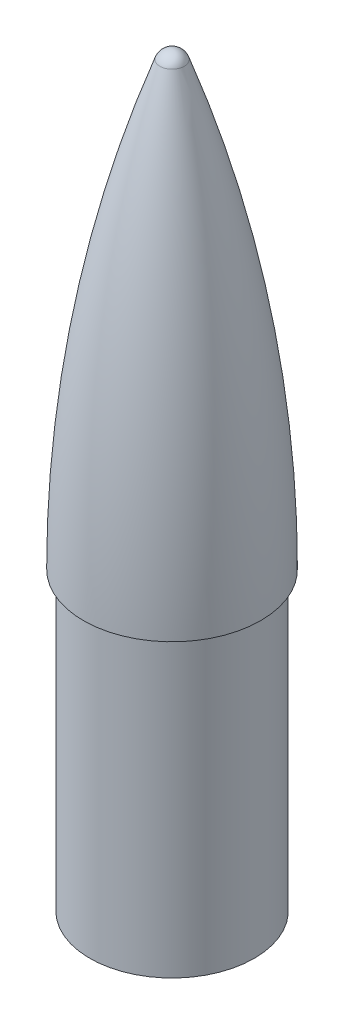
ISO-10303-21;
HEADER;
FILE_DESCRIPTION(('STEP AP214'),'2;1');
FILE_NAME('part.step','',(''),(''),'','','');
FILE_SCHEMA(('AUTOMOTIVE_DESIGN { 1 0 10303 214 1 1 1 1 }'));
ENDSEC;
DATA;
#1=APPLICATION_CONTEXT('core data for automotive mechanical design processes');
#2=APPLICATION_PROTOCOL_DEFINITION('international standard','automotive_design',2000,#1);
#3=PRODUCT_CONTEXT('',#1,'mechanical');
#4=PRODUCT('Part','Part','',(#3));
#5=PRODUCT_RELATED_PRODUCT_CATEGORY('part','',(#4));
#6=PRODUCT_DEFINITION_FORMATION('','',#4);
#7=PRODUCT_DEFINITION_CONTEXT('part definition',#1,'design');
#8=PRODUCT_DEFINITION('design','',#6,#7);
#9=PRODUCT_DEFINITION_SHAPE('','',#8);
#10=(LENGTH_UNIT() NAMED_UNIT(*) SI_UNIT(.MILLI.,.METRE.));
#11=(NAMED_UNIT(*) PLANE_ANGLE_UNIT() SI_UNIT($,.RADIAN.));
#12=(NAMED_UNIT(*) SI_UNIT($,.STERADIAN.) SOLID_ANGLE_UNIT());
#13=UNCERTAINTY_MEASURE_WITH_UNIT(LENGTH_MEASURE(1.E-05),#10,'distance_accuracy_value','');
#14=(GEOMETRIC_REPRESENTATION_CONTEXT(3) GLOBAL_UNCERTAINTY_ASSIGNED_CONTEXT((#13)) GLOBAL_UNIT_ASSIGNED_CONTEXT((#10,
#11,#12)) REPRESENTATION_CONTEXT('',''));
#15=CARTESIAN_POINT('',(0.,0.,0.));
#16=DIRECTION('',(0.,0.,1.));
#17=DIRECTION('',(1.,0.,0.));
#18=AXIS2_PLACEMENT_3D('',#15,#16,#17);
#19=CARTESIAN_POINT('',(0.,101.396949285939,0.));
#20=DIRECTION('',(0.,-1.,0.));
#21=DIRECTION('',(1.,0.,0.));
#22=AXIS2_PLACEMENT_3D('',#19,#20,#21);
#23=SPHERICAL_SURFACE('',#22,2.99999999999999);
#24=CARTESIAN_POINT('',(0.,102.405506928245,0.));
#25=DIRECTION('',(0.,-1.,0.));
#26=DIRECTION('',(1.,0.,0.));
#27=AXIS2_PLACEMENT_3D('',#24,#25,#26);
#28=CIRCLE('',#27,2.82538696148771);
#29=CARTESIAN_POINT('',(2.82538696148771,102.405506928245,0.));
#30=VERTEX_POINT('',#29);
#31=EDGE_CURVE('E10',#30,#30,#28,.T.);
#32=ORIENTED_EDGE('',*,*,#31,.F.);
#33=EDGE_LOOP('',(#32));
#34=FACE_BOUND('',#33,.T.);
#35=ADVANCED_FACE('F42',(#34),#23,.T.);
#36=CARTESIAN_POINT('',(0.,0.,0.));
#37=DIRECTION('',(0.,-1.,0.));
#38=DIRECTION('',(1.,0.,0.));
#39=AXIS2_PLACEMENT_3D('',#36,#37,#38);
#40=DEGENERATE_TOROIDAL_SURFACE('',#39,284.054779250791,304.609779250791,.F.);
#41=ORIENTED_EDGE('',*,*,#31,.T.);
#42=EDGE_LOOP('',(#41));
#43=FACE_BOUND('',#42,.T.);
#44=CARTESIAN_POINT('',(0.,0.,0.));
#45=DIRECTION('',(0.,-1.,0.));
#46=DIRECTION('',(1.,0.,0.));
#47=AXIS2_PLACEMENT_3D('',#44,#45,#46);
#48=CIRCLE('',#47,20.555);
#49=CARTESIAN_POINT('',(20.555,0.,0.));
#50=VERTEX_POINT('',#49);
#51=EDGE_CURVE('E48',#50,#50,#48,.T.);
#52=ORIENTED_EDGE('',*,*,#51,.F.);
#53=EDGE_LOOP('',(#52));
#54=FACE_BOUND('',#53,.T.);
#55=ADVANCED_FACE('F117',(#43,#54),#40,.F.);
#56=CARTESIAN_POINT('',(0.,0.,0.));
#57=DIRECTION('',(0.,-1.,0.));
#58=DIRECTION('',(1.,0.,0.));
#59=AXIS2_PLACEMENT_3D('',#56,#57,#58);
#60=PLANE('',#59);
#61=ORIENTED_EDGE('',*,*,#51,.T.);
#62=EDGE_LOOP('',(#61));
#63=FACE_BOUND('',#62,.T.);
#64=CARTESIAN_POINT('',(0.,0.,0.));
#65=DIRECTION('',(0.,-1.,0.));
#66=DIRECTION('',(1.,0.,0.));
#67=AXIS2_PLACEMENT_3D('',#64,#65,#66);
#68=CIRCLE('',#67,19.055);
#69=CARTESIAN_POINT('',(19.055,0.,0.));
#70=VERTEX_POINT('',#69);
#71=EDGE_CURVE('E52',#70,#70,#68,.T.);
#72=ORIENTED_EDGE('',*,*,#71,.F.);
#73=EDGE_LOOP('',(#72));
#74=FACE_BOUND('',#73,.T.);
#75=ADVANCED_FACE('F122',(#63,#74),#60,.T.);
#76=CARTESIAN_POINT('',(0.,102.396949285939,0.));
#77=DIRECTION('',(0.,-1.,0.));
#78=DIRECTION('',(1.,0.,0.));
#79=AXIS2_PLACEMENT_3D('',#76,#77,#78);
#80=CYLINDRICAL_SURFACE('',#79,19.055);
#81=CARTESIAN_POINT('',(0.,-68.5544592155606,0.));
#82=DIRECTION('',(0.,-1.,0.));
#83=DIRECTION('',(1.,0.,0.));
#84=AXIS2_PLACEMENT_3D('',#81,#82,#83);
#85=CIRCLE('',#84,19.055);
#86=CARTESIAN_POINT('',(19.055,-68.5544592155606,0.));
#87=VERTEX_POINT('',#86);
#88=EDGE_CURVE('E56',#87,#87,#85,.T.);
#89=ORIENTED_EDGE('',*,*,#88,.F.);
#90=EDGE_LOOP('',(#89));
#91=FACE_BOUND('',#90,.T.);
#92=ORIENTED_EDGE('',*,*,#71,.T.);
#93=EDGE_LOOP('',(#92));
#94=FACE_BOUND('',#93,.T.);
#95=ADVANCED_FACE('F93',(#91,#94),#80,.T.);
#96=CARTESIAN_POINT('',(0.,-68.5544592155606,0.));
#97=DIRECTION('',(0.,-1.,0.));
#98=DIRECTION('',(1.,0.,0.));
#99=AXIS2_PLACEMENT_3D('',#96,#97,#98);
#100=PLANE('',#99);
#101=CARTESIAN_POINT('',(0.,-68.5544592155606,-14.055));
#102=DIRECTION('',(0.,-1.,0.));
#103=DIRECTION('',(1.,0.,0.));
#104=AXIS2_PLACEMENT_3D('',#101,#102,#103);
#105=CIRCLE('',#104,2.35);
#106=CARTESIAN_POINT('',(2.35,-68.5544592155606,-14.055));
#107=VERTEX_POINT('',#106);
#108=EDGE_CURVE('E74',#107,#107,#105,.T.);
#109=ORIENTED_EDGE('',*,*,#108,.F.);
#110=EDGE_LOOP('',(#109));
#111=FACE_BOUND('',#110,.T.);
#112=CARTESIAN_POINT('',(1.00244415411021E-13,-68.5544592155606,14.055));
#113=DIRECTION('',(0.,-1.,0.));
#114=DIRECTION('',(1.,0.,0.));
#115=AXIS2_PLACEMENT_3D('',#112,#113,#114);
#116=CIRCLE('',#115,2.35);
#117=CARTESIAN_POINT('',(2.3500000000001,-68.5544592155606,14.055));
#118=VERTEX_POINT('',#117);
#119=EDGE_CURVE('E71',#118,#118,#116,.T.);
#120=ORIENTED_EDGE('',*,*,#119,.F.);
#121=EDGE_LOOP('',(#120));
#122=FACE_BOUND('',#121,.T.);
#123=ORIENTED_EDGE('',*,*,#88,.T.);
#124=EDGE_LOOP('',(#123));
#125=FACE_BOUND('',#124,.T.);
#126=CARTESIAN_POINT('',(0.,-68.5544592155606,0.));
#127=DIRECTION('',(0.,-1.,0.));
#128=DIRECTION('',(1.,0.,0.));
#129=AXIS2_PLACEMENT_3D('',#126,#127,#128);
#130=CIRCLE('',#129,10.);
#131=CARTESIAN_POINT('',(10.,-68.5544592155606,0.));
#132=VERTEX_POINT('',#131);
#133=EDGE_CURVE('E61',#132,#132,#130,.T.);
#134=ORIENTED_EDGE('',*,*,#133,.F.);
#135=EDGE_LOOP('',(#134));
#136=FACE_BOUND('',#135,.T.);
#137=ADVANCED_FACE('F89',(#111,#122,#125,#136),#100,.T.);
#138=CARTESIAN_POINT('',(0.,102.396949285939,0.));
#139=DIRECTION('',(0.,-1.,0.));
#140=DIRECTION('',(1.,0.,0.));
#141=AXIS2_PLACEMENT_3D('',#138,#139,#140);
#142=CYLINDRICAL_SURFACE('',#141,10.);
#143=ORIENTED_EDGE('',*,*,#133,.T.);
#144=EDGE_LOOP('',(#143));
#145=FACE_BOUND('',#144,.T.);
#146=CARTESIAN_POINT('',(0.,71.4455407844394,0.));
#147=DIRECTION('',(0.,-1.,0.));
#148=DIRECTION('',(1.,0.,0.));
#149=AXIS2_PLACEMENT_3D('',#146,#147,#148);
#150=CIRCLE('',#149,10.);
#151=CARTESIAN_POINT('',(10.,71.4455407844394,0.));
#152=VERTEX_POINT('',#151);
#153=EDGE_CURVE('E64',#152,#152,#150,.T.);
#154=ORIENTED_EDGE('',*,*,#153,.F.);
#155=EDGE_LOOP('',(#154));
#156=FACE_BOUND('',#155,.T.);
#157=ADVANCED_FACE('F92',(#145,#156),#142,.F.);
#158=CARTESIAN_POINT('',(0.,71.4455407844394,0.));
#159=DIRECTION('',(0.,1.,0.));
#160=DIRECTION('',(-1.,0.,0.));
#161=AXIS2_PLACEMENT_3D('',#158,#159,#160);
#162=PLANE('',#161);
#163=ORIENTED_EDGE('',*,*,#153,.T.);
#164=EDGE_LOOP('',(#163));
#165=FACE_BOUND('',#164,.T.);
#166=ADVANCED_FACE('F103',(#165),#162,.F.);
#167=CARTESIAN_POINT('',(0.,-58.5544592155606,14.055));
#168=DIRECTION('',(0.,-1.,0.));
#169=DIRECTION('',(1.,0.,0.));
#170=AXIS2_PLACEMENT_3D('',#167,#168,#169);
#171=CYLINDRICAL_SURFACE('',#170,2.35);
#172=CARTESIAN_POINT('',(0.,-58.5544592155606,14.055));
#173=DIRECTION('',(0.,-1.,0.));
#174=DIRECTION('',(1.,0.,0.));
#175=AXIS2_PLACEMENT_3D('',#172,#173,#174);
#176=CIRCLE('',#175,2.35);
#177=CARTESIAN_POINT('',(2.3500000000001,-58.5544592155606,14.055));
#178=VERTEX_POINT('',#177);
#179=EDGE_CURVE('E68',#178,#178,#176,.T.);
#180=ORIENTED_EDGE('',*,*,#179,.F.);
#181=EDGE_LOOP('',(#180));
#182=FACE_BOUND('',#181,.T.);
#183=ORIENTED_EDGE('',*,*,#119,.T.);
#184=EDGE_LOOP('',(#183));
#185=FACE_BOUND('',#184,.T.);
#186=ADVANCED_FACE('F108',(#182,#185),#171,.F.);
#187=CARTESIAN_POINT('',(0.,-58.5544592155606,14.055));
#188=DIRECTION('',(0.,-1.,0.));
#189=DIRECTION('',(1.,0.,0.));
#190=AXIS2_PLACEMENT_3D('',#187,#188,#189);
#191=PLANE('',#190);
#192=ORIENTED_EDGE('',*,*,#179,.T.);
#193=EDGE_LOOP('',(#192));
#194=FACE_BOUND('',#193,.T.);
#195=ADVANCED_FACE('F85',(#194),#191,.T.);
#196=CARTESIAN_POINT('',(0.,-58.5544592155606,-14.055));
#197=DIRECTION('',(0.,-1.,0.));
#198=DIRECTION('',(1.,0.,0.));
#199=AXIS2_PLACEMENT_3D('',#196,#197,#198);
#200=CYLINDRICAL_SURFACE('',#199,2.35);
#201=CARTESIAN_POINT('',(0.,-58.5544592155606,-14.055));
#202=DIRECTION('',(0.,-1.,0.));
#203=DIRECTION('',(1.,0.,0.));
#204=AXIS2_PLACEMENT_3D('',#201,#202,#203);
#205=CIRCLE('',#204,2.35);
#206=CARTESIAN_POINT('',(2.35,-58.5544592155606,-14.055));
#207=VERTEX_POINT('',#206);
#208=EDGE_CURVE('E67',#207,#207,#205,.T.);
#209=ORIENTED_EDGE('',*,*,#208,.F.);
#210=EDGE_LOOP('',(#209));
#211=FACE_BOUND('',#210,.T.);
#212=ORIENTED_EDGE('',*,*,#108,.T.);
#213=EDGE_LOOP('',(#212));
#214=FACE_BOUND('',#213,.T.);
#215=ADVANCED_FACE('F82',(#211,#214),#200,.F.);
#216=CARTESIAN_POINT('',(0.,-58.5544592155606,-14.055));
#217=DIRECTION('',(0.,-1.,0.));
#218=DIRECTION('',(1.,0.,0.));
#219=AXIS2_PLACEMENT_3D('',#216,#217,#218);
#220=PLANE('',#219);
#221=ORIENTED_EDGE('',*,*,#208,.T.);
#222=EDGE_LOOP('',(#221));
#223=FACE_BOUND('',#222,.T.);
#224=ADVANCED_FACE('F80',(#223),#220,.T.);
#225=CLOSED_SHELL('',(#35,#55,#75,#95,#137,#157,#166,#186,#195,#215,#224));
#226=MANIFOLD_SOLID_BREP('B2',#225);
#227=ADVANCED_BREP_SHAPE_REPRESENTATION('',(#18,#226),#14);
#228=SHAPE_DEFINITION_REPRESENTATION(#9,#227);
ENDSEC;
END-ISO-10303-21;
